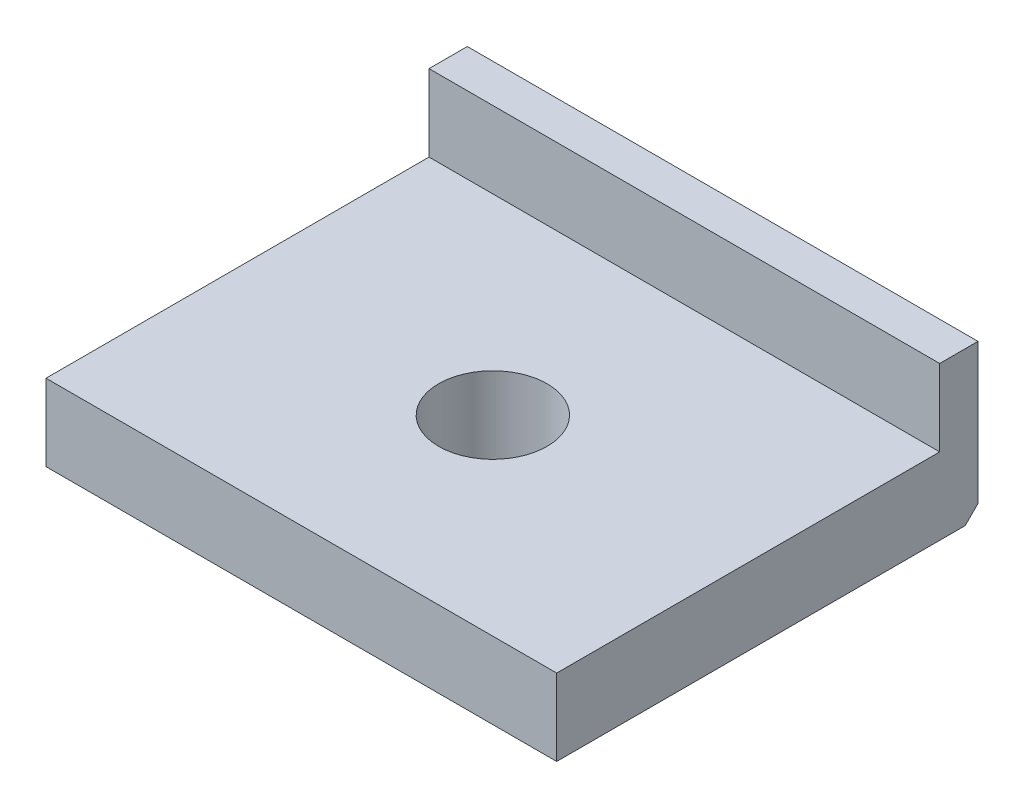
ISO-10303-21;
HEADER;
FILE_DESCRIPTION(('STEP AP214'),'2;1');
FILE_NAME('part.step','',(''),(''),'','','');
FILE_SCHEMA(('AUTOMOTIVE_DESIGN { 1 0 10303 214 1 1 1 1 }'));
ENDSEC;
DATA;
#1=APPLICATION_CONTEXT('core data for automotive mechanical design processes');
#2=APPLICATION_PROTOCOL_DEFINITION('international standard','automotive_design',2000,#1);
#3=PRODUCT_CONTEXT('',#1,'mechanical');
#4=PRODUCT('Part','Part','',(#3));
#5=PRODUCT_RELATED_PRODUCT_CATEGORY('part','',(#4));
#6=PRODUCT_DEFINITION_FORMATION('','',#4);
#7=PRODUCT_DEFINITION_CONTEXT('part definition',#1,'design');
#8=PRODUCT_DEFINITION('design','',#6,#7);
#9=PRODUCT_DEFINITION_SHAPE('','',#8);
#10=(LENGTH_UNIT() NAMED_UNIT(*) SI_UNIT(.MILLI.,.METRE.));
#11=(NAMED_UNIT(*) PLANE_ANGLE_UNIT() SI_UNIT($,.RADIAN.));
#12=(NAMED_UNIT(*) SI_UNIT($,.STERADIAN.) SOLID_ANGLE_UNIT());
#13=UNCERTAINTY_MEASURE_WITH_UNIT(LENGTH_MEASURE(1.E-05),#10,'distance_accuracy_value','');
#14=(GEOMETRIC_REPRESENTATION_CONTEXT(3) GLOBAL_UNCERTAINTY_ASSIGNED_CONTEXT((#13)) GLOBAL_UNIT_ASSIGNED_CONTEXT((#10,
#11,#12)) REPRESENTATION_CONTEXT('',''));
#15=CARTESIAN_POINT('',(0.,0.,0.));
#16=DIRECTION('',(0.,0.,1.));
#17=DIRECTION('',(1.,0.,0.));
#18=AXIS2_PLACEMENT_3D('',#15,#16,#17);
#19=CARTESIAN_POINT('',(-10.,6.,9.));
#20=DIRECTION('',(1.,0.,0.));
#21=DIRECTION('',(0.,0.,-1.));
#22=AXIS2_PLACEMENT_3D('',#19,#20,#21);
#23=PLANE('',#22);
#24=DIRECTION('',(0.,0.,1.));
#25=VECTOR('',#24,1.);
#26=CARTESIAN_POINT('',(-10.,9.,-9.));
#27=LINE('',#26,#25);
#28=CARTESIAN_POINT('',(-10.,9.,-7.49999999999999));
#29=VERTEX_POINT('',#28);
#30=CARTESIAN_POINT('',(-10.,9.,-6.));
#31=VERTEX_POINT('',#30);
#32=EDGE_CURVE('E125',#29,#31,#27,.T.);
#33=ORIENTED_EDGE('',*,*,#32,.F.);
#34=DIRECTION('',(0.,-1.,0.));
#35=VECTOR('',#34,1.);
#36=CARTESIAN_POINT('',(-10.,6.,-7.49999999999999));
#37=LINE('',#36,#35);
#38=CARTESIAN_POINT('',(-10.,3.5,-7.49999999999999));
#39=VERTEX_POINT('',#38);
#40=EDGE_CURVE('E224',#29,#39,#37,.T.);
#41=ORIENTED_EDGE('',*,*,#40,.T.);
#42=DIRECTION('',(0.,0.707106781186546,-0.707106781186549));
#43=VECTOR('',#42,1.);
#44=CARTESIAN_POINT('',(-10.,5.,-9.));
#45=LINE('',#44,#43);
#46=CARTESIAN_POINT('',(-10.,3.,-7.));
#47=VERTEX_POINT('',#46);
#48=EDGE_CURVE('E209',#39,#47,#45,.F.);
#49=ORIENTED_EDGE('',*,*,#48,.T.);
#50=DIRECTION('',(0.,0.,1.));
#51=VECTOR('',#50,1.);
#52=CARTESIAN_POINT('',(-10.,3.,9.));
#53=LINE('',#52,#51);
#54=CARTESIAN_POINT('',(-10.,3.,9.));
#55=VERTEX_POINT('',#54);
#56=EDGE_CURVE('E173',#47,#55,#53,.T.);
#57=ORIENTED_EDGE('',*,*,#56,.T.);
#58=DIRECTION('',(0.,-1.,0.));
#59=VECTOR('',#58,1.);
#60=CARTESIAN_POINT('',(-10.,6.,9.));
#61=LINE('',#60,#59);
#62=CARTESIAN_POINT('',(-10.,6.,9.));
#63=VERTEX_POINT('',#62);
#64=EDGE_CURVE('E169',#63,#55,#61,.T.);
#65=ORIENTED_EDGE('',*,*,#64,.F.);
#66=DIRECTION('',(0.,0.,1.));
#67=VECTOR('',#66,1.);
#68=CARTESIAN_POINT('',(-10.,6.,9.));
#69=LINE('',#68,#67);
#70=CARTESIAN_POINT('',(-10.,6.,-6.));
#71=VERTEX_POINT('',#70);
#72=EDGE_CURVE('E150',#71,#63,#69,.T.);
#73=ORIENTED_EDGE('',*,*,#72,.F.);
#74=DIRECTION('',(0.,-1.,0.));
#75=VECTOR('',#74,1.);
#76=CARTESIAN_POINT('',(-10.,9.,-6.));
#77=LINE('',#76,#75);
#78=EDGE_CURVE('E142',#31,#71,#77,.T.);
#79=ORIENTED_EDGE('',*,*,#78,.F.);
#80=EDGE_LOOP('',(#33,#41,#49,#57,#65,#73,#79));
#81=FACE_BOUND('',#80,.T.);
#82=ADVANCED_FACE('F39',(#81),#23,.F.);
#83=CARTESIAN_POINT('',(10.,6.,9.));
#84=DIRECTION('',(0.,0.,-1.));
#85=DIRECTION('',(-1.,0.,0.));
#86=AXIS2_PLACEMENT_3D('',#83,#84,#85);
#87=PLANE('',#86);
#88=ORIENTED_EDGE('',*,*,#64,.T.);
#89=DIRECTION('',(1.,0.,0.));
#90=VECTOR('',#89,1.);
#91=CARTESIAN_POINT('',(10.,3.,9.));
#92=LINE('',#91,#90);
#93=CARTESIAN_POINT('',(10.,3.,9.));
#94=VERTEX_POINT('',#93);
#95=EDGE_CURVE('E192',#55,#94,#92,.T.);
#96=ORIENTED_EDGE('',*,*,#95,.T.);
#97=DIRECTION('',(0.,-1.,0.));
#98=VECTOR('',#97,1.);
#99=CARTESIAN_POINT('',(10.,6.,9.));
#100=LINE('',#99,#98);
#101=CARTESIAN_POINT('',(10.,6.,9.));
#102=VERTEX_POINT('',#101);
#103=EDGE_CURVE('E165',#102,#94,#100,.T.);
#104=ORIENTED_EDGE('',*,*,#103,.F.);
#105=DIRECTION('',(1.,0.,0.));
#106=VECTOR('',#105,1.);
#107=CARTESIAN_POINT('',(10.,6.,9.));
#108=LINE('',#107,#106);
#109=EDGE_CURVE('E155',#63,#102,#108,.T.);
#110=ORIENTED_EDGE('',*,*,#109,.F.);
#111=EDGE_LOOP('',(#88,#96,#104,#110));
#112=FACE_BOUND('',#111,.T.);
#113=ADVANCED_FACE('F284',(#112),#87,.F.);
#114=CARTESIAN_POINT('',(10.,6.,9.));
#115=DIRECTION('',(-1.,0.,0.));
#116=DIRECTION('',(0.,0.,1.));
#117=AXIS2_PLACEMENT_3D('',#114,#115,#116);
#118=PLANE('',#117);
#119=DIRECTION('',(0.,-0.707106781186546,0.707106781186549));
#120=VECTOR('',#119,1.);
#121=CARTESIAN_POINT('',(10.,5.,-9.));
#122=LINE('',#121,#120);
#123=CARTESIAN_POINT('',(10.,3.,-7.));
#124=VERTEX_POINT('',#123);
#125=CARTESIAN_POINT('',(10.,3.5,-7.49999999999999));
#126=VERTEX_POINT('',#125);
#127=EDGE_CURVE('E221',#124,#126,#122,.F.);
#128=ORIENTED_EDGE('',*,*,#127,.T.);
#129=DIRECTION('',(0.,1.,0.));
#130=VECTOR('',#129,1.);
#131=CARTESIAN_POINT('',(10.,6.,-7.49999999999999));
#132=LINE('',#131,#130);
#133=CARTESIAN_POINT('',(10.,9.,-7.49999999999999));
#134=VERTEX_POINT('',#133);
#135=EDGE_CURVE('E11',#126,#134,#132,.T.);
#136=ORIENTED_EDGE('',*,*,#135,.T.);
#137=DIRECTION('',(0.,0.,-1.));
#138=VECTOR('',#137,1.);
#139=CARTESIAN_POINT('',(10.,9.,-9.));
#140=LINE('',#139,#138);
#141=CARTESIAN_POINT('',(10.,9.,-6.));
#142=VERTEX_POINT('',#141);
#143=EDGE_CURVE('E146',#142,#134,#140,.T.);
#144=ORIENTED_EDGE('',*,*,#143,.F.);
#145=DIRECTION('',(0.,-1.,0.));
#146=VECTOR('',#145,1.);
#147=CARTESIAN_POINT('',(10.,9.,-6.));
#148=LINE('',#147,#146);
#149=CARTESIAN_POINT('',(10.,6.,-6.));
#150=VERTEX_POINT('',#149);
#151=EDGE_CURVE('E144',#142,#150,#148,.T.);
#152=ORIENTED_EDGE('',*,*,#151,.T.);
#153=DIRECTION('',(0.,0.,-1.));
#154=VECTOR('',#153,1.);
#155=CARTESIAN_POINT('',(10.,6.,9.));
#156=LINE('',#155,#154);
#157=EDGE_CURVE('E162',#102,#150,#156,.T.);
#158=ORIENTED_EDGE('',*,*,#157,.F.);
#159=ORIENTED_EDGE('',*,*,#103,.T.);
#160=DIRECTION('',(0.,0.,-1.));
#161=VECTOR('',#160,1.);
#162=CARTESIAN_POINT('',(10.,3.,9.));
#163=LINE('',#162,#161);
#164=EDGE_CURVE('E195',#94,#124,#163,.T.);
#165=ORIENTED_EDGE('',*,*,#164,.T.);
#166=EDGE_LOOP('',(#128,#136,#144,#152,#158,#159,#165));
#167=FACE_BOUND('',#166,.T.);
#168=ADVANCED_FACE('F294',(#167),#118,.F.);
#169=CARTESIAN_POINT('',(10.,6.,-9.));
#170=DIRECTION('',(0.,0.,1.));
#171=DIRECTION('',(1.,0.,0.));
#172=AXIS2_PLACEMENT_3D('',#169,#170,#171);
#173=PLANE('',#172);
#174=DIRECTION('',(-1.,0.,0.));
#175=VECTOR('',#174,1.);
#176=CARTESIAN_POINT('',(10.,5.,-9.));
#177=LINE('',#176,#175);
#178=CARTESIAN_POINT('',(8.49999999999999,5.,-9.));
#179=VERTEX_POINT('',#178);
#180=CARTESIAN_POINT('',(-8.5,5.,-9.));
#181=VERTEX_POINT('',#180);
#182=EDGE_CURVE('E199',#179,#181,#177,.T.);
#183=ORIENTED_EDGE('',*,*,#182,.T.);
#184=DIRECTION('',(0.,1.,0.));
#185=VECTOR('',#184,1.);
#186=CARTESIAN_POINT('',(-8.5,6.,-9.));
#187=LINE('',#186,#185);
#188=CARTESIAN_POINT('',(-8.5,7.5,-9.));
#189=VERTEX_POINT('',#188);
#190=EDGE_CURVE('E63',#181,#189,#187,.T.);
#191=ORIENTED_EDGE('',*,*,#190,.T.);
#192=DIRECTION('',(1.,0.,0.));
#193=VECTOR('',#192,1.);
#194=CARTESIAN_POINT('',(10.,7.5,-9.));
#195=LINE('',#194,#193);
#196=CARTESIAN_POINT('',(8.49999999999999,7.5,-9.));
#197=VERTEX_POINT('',#196);
#198=EDGE_CURVE('E236',#189,#197,#195,.T.);
#199=ORIENTED_EDGE('',*,*,#198,.T.);
#200=DIRECTION('',(0.,-1.,0.));
#201=VECTOR('',#200,1.);
#202=CARTESIAN_POINT('',(8.49999999999999,6.,-9.));
#203=LINE('',#202,#201);
#204=EDGE_CURVE('E233',#197,#179,#203,.T.);
#205=ORIENTED_EDGE('',*,*,#204,.T.);
#206=EDGE_LOOP('',(#183,#191,#199,#205));
#207=FACE_BOUND('',#206,.T.);
#208=ADVANCED_FACE('F256',(#207),#173,.F.);
#209=CARTESIAN_POINT('',(0.,6.,0.));
#210=DIRECTION('',(0.,1.,0.));
#211=DIRECTION('',(0.,0.,1.));
#212=AXIS2_PLACEMENT_3D('',#209,#210,#211);
#213=PLANE('',#212);
#214=CARTESIAN_POINT('',(0.,6.,1.50000000000006));
#215=DIRECTION('',(0.,1.,0.));
#216=DIRECTION('',(0.,0.,1.));
#217=AXIS2_PLACEMENT_3D('',#214,#215,#216);
#218=CIRCLE('',#217,2.125);
#219=CARTESIAN_POINT('',(0.,6.,3.62500000000006));
#220=VERTEX_POINT('',#219);
#221=EDGE_CURVE('E178',#220,#220,#218,.T.);
#222=ORIENTED_EDGE('',*,*,#221,.F.);
#223=EDGE_LOOP('',(#222));
#224=FACE_BOUND('',#223,.T.);
#225=DIRECTION('',(1.,0.,0.));
#226=VECTOR('',#225,1.);
#227=CARTESIAN_POINT('',(-10.,6.,-6.));
#228=LINE('',#227,#226);
#229=EDGE_CURVE('E136',#71,#150,#228,.T.);
#230=ORIENTED_EDGE('',*,*,#229,.F.);
#231=ORIENTED_EDGE('',*,*,#72,.T.);
#232=ORIENTED_EDGE('',*,*,#109,.T.);
#233=ORIENTED_EDGE('',*,*,#157,.T.);
#234=EDGE_LOOP('',(#230,#231,#232,#233));
#235=FACE_BOUND('',#234,.T.);
#236=ADVANCED_FACE('F287',(#224,#235),#213,.T.);
#237=CARTESIAN_POINT('',(0.,0.,0.));
#238=DIRECTION('',(0.,1.,0.));
#239=DIRECTION('',(0.,0.,1.));
#240=AXIS2_PLACEMENT_3D('',#237,#238,#239);
#241=PLANE('',#240);
#242=CARTESIAN_POINT('',(0.,0.,1.50000000000006));
#243=DIRECTION('',(0.,1.,0.));
#244=DIRECTION('',(0.,0.,1.));
#245=AXIS2_PLACEMENT_3D('',#242,#243,#244);
#246=CIRCLE('',#245,2.125);
#247=CARTESIAN_POINT('',(0.,0.,3.62500000000006));
#248=VERTEX_POINT('',#247);
#249=EDGE_CURVE('E174',#248,#248,#246,.T.);
#250=ORIENTED_EDGE('',*,*,#249,.T.);
#251=EDGE_LOOP('',(#250));
#252=FACE_BOUND('',#251,.T.);
#253=DIRECTION('',(0.,0.,-1.));
#254=VECTOR('',#253,1.);
#255=CARTESIAN_POINT('',(-6.99999999999999,0.,0.));
#256=LINE('',#255,#254);
#257=CARTESIAN_POINT('',(-6.99999999999999,0.,5.99999999999999));
#258=VERTEX_POINT('',#257);
#259=CARTESIAN_POINT('',(-6.99999999999999,0.,-3.99999999999998));
#260=VERTEX_POINT('',#259);
#261=EDGE_CURVE('E188',#258,#260,#256,.T.);
#262=ORIENTED_EDGE('',*,*,#261,.T.);
#263=DIRECTION('',(1.,0.,0.));
#264=VECTOR('',#263,1.);
#265=CARTESIAN_POINT('',(0.,0.,-3.99999999999998));
#266=LINE('',#265,#264);
#267=CARTESIAN_POINT('',(6.99999999999998,0.,-3.99999999999998));
#268=VERTEX_POINT('',#267);
#269=EDGE_CURVE('E215',#260,#268,#266,.T.);
#270=ORIENTED_EDGE('',*,*,#269,.T.);
#271=DIRECTION('',(0.,0.,1.));
#272=VECTOR('',#271,1.);
#273=CARTESIAN_POINT('',(6.99999999999998,0.,0.));
#274=LINE('',#273,#272);
#275=CARTESIAN_POINT('',(6.99999999999998,0.,5.99999999999998));
#276=VERTEX_POINT('',#275);
#277=EDGE_CURVE('E182',#268,#276,#274,.T.);
#278=ORIENTED_EDGE('',*,*,#277,.T.);
#279=DIRECTION('',(-1.,0.,0.));
#280=VECTOR('',#279,1.);
#281=CARTESIAN_POINT('',(0.,0.,5.99999999999999));
#282=LINE('',#281,#280);
#283=EDGE_CURVE('E185',#276,#258,#282,.T.);
#284=ORIENTED_EDGE('',*,*,#283,.T.);
#285=EDGE_LOOP('',(#262,#270,#278,#284));
#286=FACE_BOUND('',#285,.T.);
#287=ADVANCED_FACE('F273',(#252,#286),#241,.F.);
#288=CARTESIAN_POINT('',(-10.,9.,-6.));
#289=DIRECTION('',(0.,0.,-1.));
#290=DIRECTION('',(-1.,0.,0.));
#291=AXIS2_PLACEMENT_3D('',#288,#289,#290);
#292=PLANE('',#291);
#293=ORIENTED_EDGE('',*,*,#229,.T.);
#294=ORIENTED_EDGE('',*,*,#151,.F.);
#295=DIRECTION('',(1.,0.,0.));
#296=VECTOR('',#295,1.);
#297=CARTESIAN_POINT('',(-10.,9.,-6.));
#298=LINE('',#297,#296);
#299=EDGE_CURVE('E128',#31,#142,#298,.T.);
#300=ORIENTED_EDGE('',*,*,#299,.F.);
#301=ORIENTED_EDGE('',*,*,#78,.T.);
#302=EDGE_LOOP('',(#293,#294,#300,#301));
#303=FACE_BOUND('',#302,.T.);
#304=ADVANCED_FACE('F141',(#303),#292,.F.);
#305=CARTESIAN_POINT('',(0.,9.,0.));
#306=DIRECTION('',(0.,1.,0.));
#307=DIRECTION('',(0.,0.,1.));
#308=AXIS2_PLACEMENT_3D('',#305,#306,#307);
#309=PLANE('',#308);
#310=ORIENTED_EDGE('',*,*,#143,.T.);
#311=DIRECTION('',(-1.,0.,0.));
#312=VECTOR('',#311,1.);
#313=CARTESIAN_POINT('',(-10.,9.,-7.49999999999999));
#314=LINE('',#313,#312);
#315=EDGE_CURVE('E49',#134,#29,#314,.T.);
#316=ORIENTED_EDGE('',*,*,#315,.T.);
#317=ORIENTED_EDGE('',*,*,#32,.T.);
#318=ORIENTED_EDGE('',*,*,#299,.T.);
#319=EDGE_LOOP('',(#310,#316,#317,#318));
#320=FACE_BOUND('',#319,.T.);
#321=ADVANCED_FACE('F127',(#320),#309,.T.);
#322=CARTESIAN_POINT('',(0.,9.,1.50000000000006));
#323=DIRECTION('',(0.,-1.,0.));
#324=DIRECTION('',(0.,0.,-1.));
#325=AXIS2_PLACEMENT_3D('',#322,#323,#324);
#326=CYLINDRICAL_SURFACE('',#325,2.125);
#327=ORIENTED_EDGE('',*,*,#221,.T.);
#328=EDGE_LOOP('',(#327));
#329=FACE_BOUND('',#328,.T.);
#330=ORIENTED_EDGE('',*,*,#249,.F.);
#331=EDGE_LOOP('',(#330));
#332=FACE_BOUND('',#331,.T.);
#333=ADVANCED_FACE('F314',(#329,#332),#326,.F.);
#334=CARTESIAN_POINT('',(10.,3.,9.));
#335=DIRECTION('',(-0.707106781186546,0.707106781186549,0.));
#336=DIRECTION('',(0.,0.,-1.));
#337=AXIS2_PLACEMENT_3D('',#334,#335,#336);
#338=PLANE('',#337);
#339=ORIENTED_EDGE('',*,*,#277,.F.);
#340=DIRECTION('',(0.577350269189627,0.577350269189625,-0.577350269189627));
#341=VECTOR('',#340,1.);
#342=CARTESIAN_POINT('',(4.66666666666665,-2.33333333333332,-1.66666666666665));
#343=LINE('',#342,#341);
#344=EDGE_CURVE('E218',#268,#124,#343,.T.);
#345=ORIENTED_EDGE('',*,*,#344,.T.);
#346=ORIENTED_EDGE('',*,*,#164,.F.);
#347=DIRECTION('',(-0.577350269189626,-0.577350269189624,-0.577350269189626));
#348=VECTOR('',#347,1.);
#349=CARTESIAN_POINT('',(10.,3.,9.));
#350=LINE('',#349,#348);
#351=EDGE_CURVE('E179',#276,#94,#350,.F.);
#352=ORIENTED_EDGE('',*,*,#351,.F.);
#353=EDGE_LOOP('',(#339,#345,#346,#352));
#354=FACE_BOUND('',#353,.T.);
#355=ADVANCED_FACE('F276',(#354),#338,.F.);
#356=CARTESIAN_POINT('',(10.,3.,9.));
#357=DIRECTION('',(0.,0.707106781186549,-0.707106781186546));
#358=DIRECTION('',(1.,0.,0.));
#359=AXIS2_PLACEMENT_3D('',#356,#357,#358);
#360=PLANE('',#359);
#361=ORIENTED_EDGE('',*,*,#351,.T.);
#362=ORIENTED_EDGE('',*,*,#95,.F.);
#363=DIRECTION('',(0.577350269189626,-0.577350269189624,-0.577350269189626));
#364=VECTOR('',#363,1.);
#365=CARTESIAN_POINT('',(-3.33333333333332,-3.66666666666666,2.33333333333332));
#366=LINE('',#365,#364);
#367=EDGE_CURVE('E200',#258,#55,#366,.F.);
#368=ORIENTED_EDGE('',*,*,#367,.F.);
#369=ORIENTED_EDGE('',*,*,#283,.F.);
#370=EDGE_LOOP('',(#361,#362,#368,#369));
#371=FACE_BOUND('',#370,.T.);
#372=ADVANCED_FACE('F280',(#371),#360,.F.);
#373=CARTESIAN_POINT('',(-10.,3.,9.));
#374=DIRECTION('',(0.707106781186546,0.707106781186549,0.));
#375=DIRECTION('',(0.,0.,1.));
#376=AXIS2_PLACEMENT_3D('',#373,#374,#375);
#377=PLANE('',#376);
#378=ORIENTED_EDGE('',*,*,#56,.F.);
#379=DIRECTION('',(0.577350269189627,-0.577350269189625,0.577350269189627));
#380=VECTOR('',#379,1.);
#381=CARTESIAN_POINT('',(-4.66666666666666,-2.33333333333332,-1.66666666666665));
#382=LINE('',#381,#380);
#383=EDGE_CURVE('E212',#47,#260,#382,.T.);
#384=ORIENTED_EDGE('',*,*,#383,.T.);
#385=ORIENTED_EDGE('',*,*,#261,.F.);
#386=ORIENTED_EDGE('',*,*,#367,.T.);
#387=EDGE_LOOP('',(#378,#384,#385,#386));
#388=FACE_BOUND('',#387,.T.);
#389=ADVANCED_FACE('F265',(#388),#377,.F.);
#390=CARTESIAN_POINT('',(10.,5.,-9.));
#391=DIRECTION('',(0.,0.707106781186549,0.707106781186546));
#392=DIRECTION('',(-1.,0.,0.));
#393=AXIS2_PLACEMENT_3D('',#390,#391,#392);
#394=PLANE('',#393);
#395=ORIENTED_EDGE('',*,*,#48,.F.);
#396=DIRECTION('',(0.577350269189626,0.577350269189625,-0.577350269189627));
#397=VECTOR('',#396,1.);
#398=CARTESIAN_POINT('',(-2.33333333333333,11.1666666666667,-15.1666666666667));
#399=LINE('',#398,#397);
#400=EDGE_CURVE('E230',#39,#181,#399,.T.);
#401=ORIENTED_EDGE('',*,*,#400,.T.);
#402=ORIENTED_EDGE('',*,*,#182,.F.);
#403=DIRECTION('',(0.577350269189626,-0.577350269189625,0.577350269189627));
#404=VECTOR('',#403,1.);
#405=CARTESIAN_POINT('',(8.99999999999999,4.5,-8.5));
#406=LINE('',#405,#404);
#407=EDGE_CURVE('E227',#179,#126,#406,.T.);
#408=ORIENTED_EDGE('',*,*,#407,.T.);
#409=ORIENTED_EDGE('',*,*,#127,.F.);
#410=ORIENTED_EDGE('',*,*,#344,.F.);
#411=ORIENTED_EDGE('',*,*,#269,.F.);
#412=ORIENTED_EDGE('',*,*,#383,.F.);
#413=EDGE_LOOP('',(#395,#401,#402,#408,#409,#410,#411,#412));
#414=FACE_BOUND('',#413,.T.);
#415=ADVANCED_FACE('F259',(#414),#394,.F.);
#416=CARTESIAN_POINT('',(8.49999999999999,6.,-9.));
#417=DIRECTION('',(-0.707106781186548,0.,0.707106781186547));
#418=DIRECTION('',(0.,-1.,0.));
#419=AXIS2_PLACEMENT_3D('',#416,#417,#418);
#420=PLANE('',#419);
#421=ORIENTED_EDGE('',*,*,#407,.F.);
#422=ORIENTED_EDGE('',*,*,#204,.F.);
#423=DIRECTION('',(-0.577350269189625,-0.577350269189625,-0.577350269189627));
#424=VECTOR('',#423,1.);
#425=CARTESIAN_POINT('',(7.99999999999999,7.,-9.5));
#426=LINE('',#425,#424);
#427=EDGE_CURVE('E43',#134,#197,#426,.T.);
#428=ORIENTED_EDGE('',*,*,#427,.F.);
#429=ORIENTED_EDGE('',*,*,#135,.F.);
#430=EDGE_LOOP('',(#421,#422,#428,#429));
#431=FACE_BOUND('',#430,.T.);
#432=ADVANCED_FACE('F41',(#431),#420,.F.);
#433=CARTESIAN_POINT('',(0.,9.,-7.49999999999999));
#434=DIRECTION('',(0.,0.707106781186548,-0.707106781186547));
#435=DIRECTION('',(1.,0.,0.));
#436=AXIS2_PLACEMENT_3D('',#433,#434,#435);
#437=PLANE('',#436);
#438=ORIENTED_EDGE('',*,*,#427,.T.);
#439=ORIENTED_EDGE('',*,*,#198,.F.);
#440=DIRECTION('',(0.577350269189626,-0.577350269189625,-0.577350269189626));
#441=VECTOR('',#440,1.);
#442=CARTESIAN_POINT('',(-6.66666666666667,5.66666666666667,-10.8333333333333));
#443=LINE('',#442,#441);
#444=EDGE_CURVE('E242',#29,#189,#443,.T.);
#445=ORIENTED_EDGE('',*,*,#444,.F.);
#446=ORIENTED_EDGE('',*,*,#315,.F.);
#447=EDGE_LOOP('',(#438,#439,#445,#446));
#448=FACE_BOUND('',#447,.T.);
#449=ADVANCED_FACE('F251',(#448),#437,.T.);
#450=CARTESIAN_POINT('',(-10.,6.,-7.49999999999999));
#451=DIRECTION('',(0.707106781186548,0.,0.707106781186547));
#452=DIRECTION('',(0.,-1.,0.));
#453=AXIS2_PLACEMENT_3D('',#450,#451,#452);
#454=PLANE('',#453);
#455=ORIENTED_EDGE('',*,*,#444,.T.);
#456=ORIENTED_EDGE('',*,*,#190,.F.);
#457=ORIENTED_EDGE('',*,*,#400,.F.);
#458=ORIENTED_EDGE('',*,*,#40,.F.);
#459=EDGE_LOOP('',(#455,#456,#457,#458));
#460=FACE_BOUND('',#459,.T.);
#461=ADVANCED_FACE('F262',(#460),#454,.F.);
#462=CLOSED_SHELL('',(#82,#113,#168,#208,#236,#287,#304,#321,#333,#355,#372,#389,#415,#432,#449,#461));
#463=MANIFOLD_SOLID_BREP('B2',#462);
#464=ADVANCED_BREP_SHAPE_REPRESENTATION('',(#18,#463),#14);
#465=SHAPE_DEFINITION_REPRESENTATION(#9,#464);
ENDSEC;
END-ISO-10303-21;
